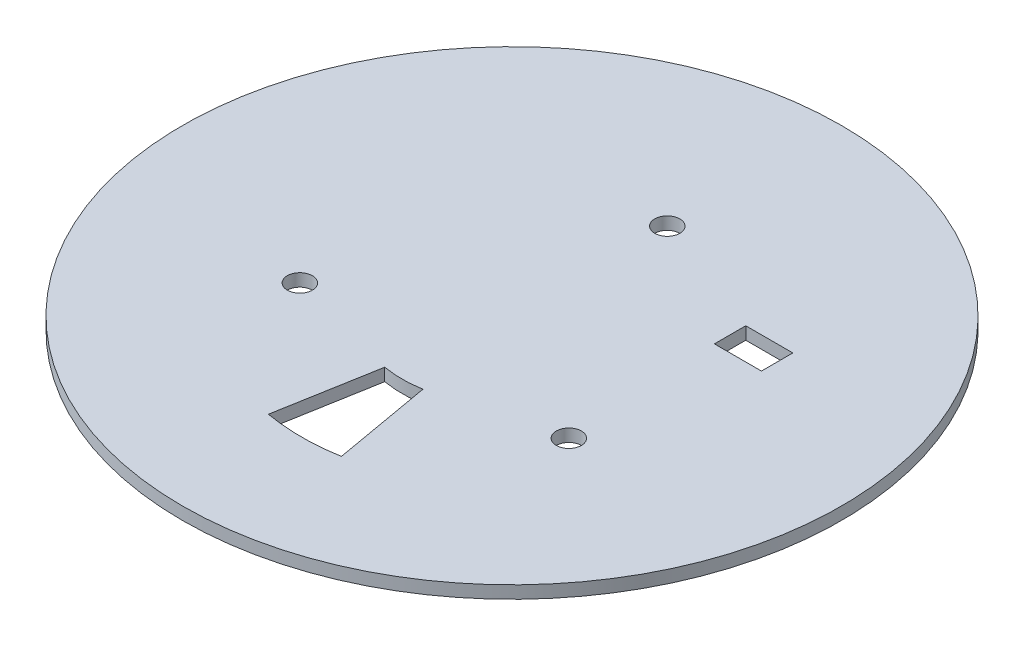
ISO-10303-21;
HEADER;
FILE_DESCRIPTION(('STEP AP214'),'2;1');
FILE_NAME('part.step','',(''),(''),'','','');
FILE_SCHEMA(('AUTOMOTIVE_DESIGN { 1 0 10303 214 1 1 1 1 }'));
ENDSEC;
DATA;
#1=APPLICATION_CONTEXT('core data for automotive mechanical design processes');
#2=APPLICATION_PROTOCOL_DEFINITION('international standard','automotive_design',2000,#1);
#3=PRODUCT_CONTEXT('',#1,'mechanical');
#4=PRODUCT('Part','Part','',(#3));
#5=PRODUCT_RELATED_PRODUCT_CATEGORY('part','',(#4));
#6=PRODUCT_DEFINITION_FORMATION('','',#4);
#7=PRODUCT_DEFINITION_CONTEXT('part definition',#1,'design');
#8=PRODUCT_DEFINITION('design','',#6,#7);
#9=PRODUCT_DEFINITION_SHAPE('','',#8);
#10=(LENGTH_UNIT() NAMED_UNIT(*) SI_UNIT(.MILLI.,.METRE.));
#11=(NAMED_UNIT(*) PLANE_ANGLE_UNIT() SI_UNIT($,.RADIAN.));
#12=(NAMED_UNIT(*) SI_UNIT($,.STERADIAN.) SOLID_ANGLE_UNIT());
#13=UNCERTAINTY_MEASURE_WITH_UNIT(LENGTH_MEASURE(1.E-05),#10,'distance_accuracy_value','');
#14=(GEOMETRIC_REPRESENTATION_CONTEXT(3) GLOBAL_UNCERTAINTY_ASSIGNED_CONTEXT((#13)) GLOBAL_UNIT_ASSIGNED_CONTEXT((#10,
#11,#12)) REPRESENTATION_CONTEXT('',''));
#15=CARTESIAN_POINT('',(0.,0.,0.));
#16=DIRECTION('',(0.,0.,1.));
#17=DIRECTION('',(1.,0.,0.));
#18=AXIS2_PLACEMENT_3D('',#15,#16,#17);
#19=CARTESIAN_POINT('',(0.,4.,0.));
#20=DIRECTION('',(0.,-1.,0.));
#21=DIRECTION('',(0.,0.,-1.));
#22=AXIS2_PLACEMENT_3D('',#19,#20,#21);
#23=CYLINDRICAL_SURFACE('',#22,105.);
#24=CARTESIAN_POINT('',(0.,4.,0.));
#25=DIRECTION('',(0.,1.,0.));
#26=DIRECTION('',(0.,0.,1.));
#27=AXIS2_PLACEMENT_3D('',#24,#25,#26);
#28=CIRCLE('',#27,105.);
#29=CARTESIAN_POINT('',(0.,4.,105.));
#30=VERTEX_POINT('',#29);
#31=EDGE_CURVE('E11',#30,#30,#28,.T.);
#32=ORIENTED_EDGE('',*,*,#31,.F.);
#33=EDGE_LOOP('',(#32));
#34=FACE_BOUND('',#33,.T.);
#35=CARTESIAN_POINT('',(0.,0.,0.));
#36=DIRECTION('',(0.,1.,0.));
#37=DIRECTION('',(0.,0.,1.));
#38=AXIS2_PLACEMENT_3D('',#35,#36,#37);
#39=CIRCLE('',#38,105.);
#40=CARTESIAN_POINT('',(0.,0.,105.));
#41=VERTEX_POINT('',#40);
#42=EDGE_CURVE('E36',#41,#41,#39,.T.);
#43=ORIENTED_EDGE('',*,*,#42,.T.);
#44=EDGE_LOOP('',(#43));
#45=FACE_BOUND('',#44,.T.);
#46=ADVANCED_FACE('F33',(#34,#45),#23,.T.);
#47=CARTESIAN_POINT('',(0.,4.,0.));
#48=DIRECTION('',(0.,1.,0.));
#49=DIRECTION('',(0.,0.,1.));
#50=AXIS2_PLACEMENT_3D('',#47,#48,#49);
#51=PLANE('',#50);
#52=DIRECTION('',(0.,0.,1.));
#53=VECTOR('',#52,1.);
#54=CARTESIAN_POINT('',(40.,4.,-34.48));
#55=LINE('',#54,#53);
#56=CARTESIAN_POINT('',(40.,4.,-34.48));
#57=VERTEX_POINT('',#56);
#58=CARTESIAN_POINT('',(40.,4.,-24.48));
#59=VERTEX_POINT('',#58);
#60=EDGE_CURVE('E47',#57,#59,#55,.T.);
#61=ORIENTED_EDGE('',*,*,#60,.F.);
#62=DIRECTION('',(-1.,0.,0.));
#63=VECTOR('',#62,1.);
#64=CARTESIAN_POINT('',(55.,4.,-34.48));
#65=LINE('',#64,#63);
#66=CARTESIAN_POINT('',(55.,4.,-34.48));
#67=VERTEX_POINT('',#66);
#68=EDGE_CURVE('E105',#67,#57,#65,.T.);
#69=ORIENTED_EDGE('',*,*,#68,.F.);
#70=DIRECTION('',(0.,0.,-1.));
#71=VECTOR('',#70,1.);
#72=CARTESIAN_POINT('',(55.,4.,-24.48));
#73=LINE('',#72,#71);
#74=CARTESIAN_POINT('',(55.,4.,-24.48));
#75=VERTEX_POINT('',#74);
#76=EDGE_CURVE('E125',#75,#67,#73,.T.);
#77=ORIENTED_EDGE('',*,*,#76,.F.);
#78=DIRECTION('',(1.,0.,0.));
#79=VECTOR('',#78,1.);
#80=CARTESIAN_POINT('',(40.,4.,-24.48));
#81=LINE('',#80,#79);
#82=EDGE_CURVE('E119',#59,#75,#81,.T.);
#83=ORIENTED_EDGE('',*,*,#82,.F.);
#84=EDGE_LOOP('',(#61,#69,#77,#83));
#85=FACE_BOUND('',#84,.T.);
#86=CARTESIAN_POINT('',(42.850936979254,4.,24.74));
#87=DIRECTION('',(0.,1.,0.));
#88=DIRECTION('',(0.,0.,1.));
#89=AXIS2_PLACEMENT_3D('',#86,#87,#88);
#90=CIRCLE('',#89,4.);
#91=CARTESIAN_POINT('',(42.850936979254,4.,28.74));
#92=VERTEX_POINT('',#91);
#93=EDGE_CURVE('E138',#92,#92,#90,.T.);
#94=ORIENTED_EDGE('',*,*,#93,.F.);
#95=EDGE_LOOP('',(#94));
#96=FACE_BOUND('',#95,.T.);
#97=CARTESIAN_POINT('',(0.,4.,-49.48));
#98=DIRECTION('',(0.,1.,0.));
#99=DIRECTION('',(0.,0.,1.));
#100=AXIS2_PLACEMENT_3D('',#97,#98,#99);
#101=CIRCLE('',#100,4.);
#102=CARTESIAN_POINT('',(0.,4.,-45.48));
#103=VERTEX_POINT('',#102);
#104=EDGE_CURVE('E144',#103,#103,#101,.T.);
#105=ORIENTED_EDGE('',*,*,#104,.F.);
#106=EDGE_LOOP('',(#105));
#107=FACE_BOUND('',#106,.T.);
#108=CARTESIAN_POINT('',(-42.8509369792542,4.,24.7399999999997));
#109=DIRECTION('',(0.,1.,0.));
#110=DIRECTION('',(0.,0.,1.));
#111=AXIS2_PLACEMENT_3D('',#108,#109,#110);
#112=CIRCLE('',#111,4.00000000000001);
#113=CARTESIAN_POINT('',(-42.8509369792542,4.,28.7399999999997));
#114=VERTEX_POINT('',#113);
#115=EDGE_CURVE('E111',#114,#114,#112,.T.);
#116=ORIENTED_EDGE('',*,*,#115,.F.);
#117=EDGE_LOOP('',(#116));
#118=FACE_BOUND('',#117,.T.);
#119=CARTESIAN_POINT('',(0.,4.,0.));
#120=DIRECTION('',(0.,1.,0.));
#121=DIRECTION('',(0.,0.,1.));
#122=AXIS2_PLACEMENT_3D('',#119,#120,#121);
#123=CIRCLE('',#122,67.);
#124=CARTESIAN_POINT('',(-11.6344279036839,4.,65.982119451818));
#125=VERTEX_POINT('',#124);
#126=CARTESIAN_POINT('',(11.6344279036839,4.,65.982119451818));
#127=VERTEX_POINT('',#126);
#128=EDGE_CURVE('E137',#125,#127,#123,.T.);
#129=ORIENTED_EDGE('',*,*,#128,.F.);
#130=DIRECTION('',(-0.173648177666923,0.,0.984807753012209));
#131=VECTOR('',#130,1.);
#132=CARTESIAN_POINT('',(-6.07768621834235,4.,34.4682713554273));
#133=LINE('',#132,#131);
#134=CARTESIAN_POINT('',(-6.07768621834235,4.,34.4682713554273));
#135=VERTEX_POINT('',#134);
#136=EDGE_CURVE('E156',#135,#125,#133,.T.);
#137=ORIENTED_EDGE('',*,*,#136,.F.);
#138=CARTESIAN_POINT('',(0.,4.,0.));
#139=DIRECTION('',(0.,-1.,0.));
#140=DIRECTION('',(0.,0.,1.));
#141=AXIS2_PLACEMENT_3D('',#138,#139,#140);
#142=CIRCLE('',#141,35.);
#143=CARTESIAN_POINT('',(6.0776862183423,4.,34.4682713554273));
#144=VERTEX_POINT('',#143);
#145=EDGE_CURVE('E170',#144,#135,#142,.T.);
#146=ORIENTED_EDGE('',*,*,#145,.F.);
#147=DIRECTION('',(-0.173648177666923,0.,-0.984807753012209));
#148=VECTOR('',#147,1.);
#149=CARTESIAN_POINT('',(6.07768621834231,4.,34.4682713554273));
#150=LINE('',#149,#148);
#151=EDGE_CURVE('E167',#127,#144,#150,.T.);
#152=ORIENTED_EDGE('',*,*,#151,.F.);
#153=EDGE_LOOP('',(#129,#137,#146,#152));
#154=FACE_BOUND('',#153,.T.);
#155=ORIENTED_EDGE('',*,*,#31,.T.);
#156=EDGE_LOOP('',(#155));
#157=FACE_BOUND('',#156,.T.);
#158=ADVANCED_FACE('F192',(#85,#96,#107,#118,#154,#157),#51,.T.);
#159=CARTESIAN_POINT('',(0.,0.,0.));
#160=DIRECTION('',(0.,1.,0.));
#161=DIRECTION('',(0.,0.,1.));
#162=AXIS2_PLACEMENT_3D('',#159,#160,#161);
#163=PLANE('',#162);
#164=DIRECTION('',(1.,0.,0.));
#165=VECTOR('',#164,1.);
#166=CARTESIAN_POINT('',(55.,0.,-34.48));
#167=LINE('',#166,#165);
#168=CARTESIAN_POINT('',(40.,0.,-34.48));
#169=VERTEX_POINT('',#168);
#170=CARTESIAN_POINT('',(55.,0.,-34.48));
#171=VERTEX_POINT('',#170);
#172=EDGE_CURVE('E117',#169,#171,#167,.T.);
#173=ORIENTED_EDGE('',*,*,#172,.F.);
#174=DIRECTION('',(0.,0.,-1.));
#175=VECTOR('',#174,1.);
#176=CARTESIAN_POINT('',(40.,0.,-34.48));
#177=LINE('',#176,#175);
#178=CARTESIAN_POINT('',(40.,0.,-24.48));
#179=VERTEX_POINT('',#178);
#180=EDGE_CURVE('E99',#179,#169,#177,.T.);
#181=ORIENTED_EDGE('',*,*,#180,.F.);
#182=DIRECTION('',(-1.,0.,0.));
#183=VECTOR('',#182,1.);
#184=CARTESIAN_POINT('',(40.,0.,-24.48));
#185=LINE('',#184,#183);
#186=CARTESIAN_POINT('',(55.,0.,-24.48));
#187=VERTEX_POINT('',#186);
#188=EDGE_CURVE('E108',#187,#179,#185,.T.);
#189=ORIENTED_EDGE('',*,*,#188,.F.);
#190=DIRECTION('',(0.,0.,1.));
#191=VECTOR('',#190,1.);
#192=CARTESIAN_POINT('',(55.,0.,-24.48));
#193=LINE('',#192,#191);
#194=EDGE_CURVE('E55',#171,#187,#193,.T.);
#195=ORIENTED_EDGE('',*,*,#194,.F.);
#196=EDGE_LOOP('',(#173,#181,#189,#195));
#197=FACE_BOUND('',#196,.T.);
#198=CARTESIAN_POINT('',(42.850936979254,0.,24.74));
#199=DIRECTION('',(0.,1.,0.));
#200=DIRECTION('',(0.,0.,1.));
#201=AXIS2_PLACEMENT_3D('',#198,#199,#200);
#202=CIRCLE('',#201,4.);
#203=CARTESIAN_POINT('',(42.850936979254,0.,28.74));
#204=VERTEX_POINT('',#203);
#205=EDGE_CURVE('E134',#204,#204,#202,.T.);
#206=ORIENTED_EDGE('',*,*,#205,.T.);
#207=EDGE_LOOP('',(#206));
#208=FACE_BOUND('',#207,.T.);
#209=CARTESIAN_POINT('',(0.,0.,-49.48));
#210=DIRECTION('',(0.,1.,0.));
#211=DIRECTION('',(0.,0.,1.));
#212=AXIS2_PLACEMENT_3D('',#209,#210,#211);
#213=CIRCLE('',#212,4.);
#214=CARTESIAN_POINT('',(0.,0.,-45.48));
#215=VERTEX_POINT('',#214);
#216=EDGE_CURVE('E141',#215,#215,#213,.T.);
#217=ORIENTED_EDGE('',*,*,#216,.T.);
#218=EDGE_LOOP('',(#217));
#219=FACE_BOUND('',#218,.T.);
#220=CARTESIAN_POINT('',(-42.8509369792542,0.,24.7399999999997));
#221=DIRECTION('',(0.,1.,0.));
#222=DIRECTION('',(0.,0.,1.));
#223=AXIS2_PLACEMENT_3D('',#220,#221,#222);
#224=CIRCLE('',#223,4.00000000000001);
#225=CARTESIAN_POINT('',(-42.8509369792542,0.,28.7399999999997));
#226=VERTEX_POINT('',#225);
#227=EDGE_CURVE('E147',#226,#226,#224,.T.);
#228=ORIENTED_EDGE('',*,*,#227,.T.);
#229=EDGE_LOOP('',(#228));
#230=FACE_BOUND('',#229,.T.);
#231=DIRECTION('',(-0.173648177666923,0.,0.984807753012209));
#232=VECTOR('',#231,1.);
#233=CARTESIAN_POINT('',(-6.07768621834235,0.,34.4682713554273));
#234=LINE('',#233,#232);
#235=CARTESIAN_POINT('',(-6.07768621834235,0.,34.4682713554273));
#236=VERTEX_POINT('',#235);
#237=CARTESIAN_POINT('',(-11.6344279036839,0.,65.982119451818));
#238=VERTEX_POINT('',#237);
#239=EDGE_CURVE('E162',#236,#238,#234,.T.);
#240=ORIENTED_EDGE('',*,*,#239,.T.);
#241=CARTESIAN_POINT('',(0.,0.,0.));
#242=DIRECTION('',(0.,1.,0.));
#243=DIRECTION('',(0.,0.,1.));
#244=AXIS2_PLACEMENT_3D('',#241,#242,#243);
#245=CIRCLE('',#244,67.);
#246=CARTESIAN_POINT('',(11.6344279036839,0.,65.982119451818));
#247=VERTEX_POINT('',#246);
#248=EDGE_CURVE('E152',#238,#247,#245,.T.);
#249=ORIENTED_EDGE('',*,*,#248,.T.);
#250=DIRECTION('',(-0.173648177666923,0.,-0.984807753012209));
#251=VECTOR('',#250,1.);
#252=CARTESIAN_POINT('',(6.07768621834231,0.,34.4682713554273));
#253=LINE('',#252,#251);
#254=CARTESIAN_POINT('',(6.0776862183423,0.,34.4682713554273));
#255=VERTEX_POINT('',#254);
#256=EDGE_CURVE('E155',#247,#255,#253,.T.);
#257=ORIENTED_EDGE('',*,*,#256,.T.);
#258=CARTESIAN_POINT('',(0.,0.,0.));
#259=DIRECTION('',(0.,-1.,0.));
#260=DIRECTION('',(0.,0.,1.));
#261=AXIS2_PLACEMENT_3D('',#258,#259,#260);
#262=CIRCLE('',#261,35.);
#263=EDGE_CURVE('E159',#255,#236,#262,.T.);
#264=ORIENTED_EDGE('',*,*,#263,.T.);
#265=EDGE_LOOP('',(#240,#249,#257,#264));
#266=FACE_BOUND('',#265,.T.);
#267=ORIENTED_EDGE('',*,*,#42,.F.);
#268=EDGE_LOOP('',(#267));
#269=FACE_BOUND('',#268,.T.);
#270=ADVANCED_FACE('F114',(#197,#208,#219,#230,#266,#269),#163,.F.);
#271=CARTESIAN_POINT('',(0.,0.,0.));
#272=DIRECTION('',(0.,1.,0.));
#273=DIRECTION('',(0.,0.,1.));
#274=AXIS2_PLACEMENT_3D('',#271,#272,#273);
#275=CYLINDRICAL_SURFACE('',#274,67.);
#276=ORIENTED_EDGE('',*,*,#128,.T.);
#277=DIRECTION('',(0.,1.,0.));
#278=VECTOR('',#277,1.);
#279=CARTESIAN_POINT('',(11.6344279036839,0.,65.982119451818));
#280=LINE('',#279,#278);
#281=EDGE_CURVE('E165',#247,#127,#280,.T.);
#282=ORIENTED_EDGE('',*,*,#281,.F.);
#283=ORIENTED_EDGE('',*,*,#248,.F.);
#284=DIRECTION('',(0.,1.,0.));
#285=VECTOR('',#284,1.);
#286=CARTESIAN_POINT('',(-11.6344279036839,0.,65.982119451818));
#287=LINE('',#286,#285);
#288=EDGE_CURVE('E175',#238,#125,#287,.T.);
#289=ORIENTED_EDGE('',*,*,#288,.T.);
#290=EDGE_LOOP('',(#276,#282,#283,#289));
#291=FACE_BOUND('',#290,.T.);
#292=ADVANCED_FACE('F200',(#291),#275,.F.);
#293=CARTESIAN_POINT('',(-6.07768621834235,0.,34.4682713554273));
#294=DIRECTION('',(-0.984807753012209,0.,-0.173648177666923));
#295=DIRECTION('',(-0.173648177666923,0.,0.984807753012209));
#296=AXIS2_PLACEMENT_3D('',#293,#294,#295);
#297=PLANE('',#296);
#298=ORIENTED_EDGE('',*,*,#136,.T.);
#299=ORIENTED_EDGE('',*,*,#288,.F.);
#300=ORIENTED_EDGE('',*,*,#239,.F.);
#301=DIRECTION('',(0.,1.,0.));
#302=VECTOR('',#301,1.);
#303=CARTESIAN_POINT('',(-6.07768621834235,0.,34.4682713554273));
#304=LINE('',#303,#302);
#305=EDGE_CURVE('E177',#236,#135,#304,.T.);
#306=ORIENTED_EDGE('',*,*,#305,.T.);
#307=EDGE_LOOP('',(#298,#299,#300,#306));
#308=FACE_BOUND('',#307,.T.);
#309=ADVANCED_FACE('F202',(#308),#297,.F.);
#310=CARTESIAN_POINT('',(0.,0.,0.));
#311=DIRECTION('',(0.,1.,0.));
#312=DIRECTION('',(0.,0.,1.));
#313=AXIS2_PLACEMENT_3D('',#310,#311,#312);
#314=CYLINDRICAL_SURFACE('',#313,35.);
#315=ORIENTED_EDGE('',*,*,#145,.T.);
#316=ORIENTED_EDGE('',*,*,#305,.F.);
#317=ORIENTED_EDGE('',*,*,#263,.F.);
#318=DIRECTION('',(0.,1.,0.));
#319=VECTOR('',#318,1.);
#320=CARTESIAN_POINT('',(6.0776862183423,0.,34.4682713554273));
#321=LINE('',#320,#319);
#322=EDGE_CURVE('E179',#255,#144,#321,.T.);
#323=ORIENTED_EDGE('',*,*,#322,.T.);
#324=EDGE_LOOP('',(#315,#316,#317,#323));
#325=FACE_BOUND('',#324,.T.);
#326=ADVANCED_FACE('F196',(#325),#314,.T.);
#327=CARTESIAN_POINT('',(6.07768621834231,0.,34.4682713554273));
#328=DIRECTION('',(0.984807753012209,0.,-0.173648177666923));
#329=DIRECTION('',(-0.173648177666923,0.,-0.984807753012209));
#330=AXIS2_PLACEMENT_3D('',#327,#328,#329);
#331=PLANE('',#330);
#332=ORIENTED_EDGE('',*,*,#151,.T.);
#333=ORIENTED_EDGE('',*,*,#322,.F.);
#334=ORIENTED_EDGE('',*,*,#256,.F.);
#335=ORIENTED_EDGE('',*,*,#281,.T.);
#336=EDGE_LOOP('',(#332,#333,#334,#335));
#337=FACE_BOUND('',#336,.T.);
#338=ADVANCED_FACE('F185',(#337),#331,.F.);
#339=CARTESIAN_POINT('',(-42.8509369792542,0.,24.7399999999997));
#340=DIRECTION('',(0.,1.,0.));
#341=DIRECTION('',(0.,0.,1.));
#342=AXIS2_PLACEMENT_3D('',#339,#340,#341);
#343=CYLINDRICAL_SURFACE('',#342,4.00000000000001);
#344=ORIENTED_EDGE('',*,*,#227,.F.);
#345=EDGE_LOOP('',(#344));
#346=FACE_BOUND('',#345,.T.);
#347=ORIENTED_EDGE('',*,*,#115,.T.);
#348=EDGE_LOOP('',(#347));
#349=FACE_BOUND('',#348,.T.);
#350=ADVANCED_FACE('F230',(#346,#349),#343,.F.);
#351=CARTESIAN_POINT('',(0.,0.,-49.48));
#352=DIRECTION('',(0.,1.,0.));
#353=DIRECTION('',(0.,0.,1.));
#354=AXIS2_PLACEMENT_3D('',#351,#352,#353);
#355=CYLINDRICAL_SURFACE('',#354,4.);
#356=ORIENTED_EDGE('',*,*,#216,.F.);
#357=EDGE_LOOP('',(#356));
#358=FACE_BOUND('',#357,.T.);
#359=ORIENTED_EDGE('',*,*,#104,.T.);
#360=EDGE_LOOP('',(#359));
#361=FACE_BOUND('',#360,.T.);
#362=ADVANCED_FACE('F234',(#358,#361),#355,.F.);
#363=CARTESIAN_POINT('',(42.850936979254,0.,24.74));
#364=DIRECTION('',(0.,1.,0.));
#365=DIRECTION('',(0.,0.,1.));
#366=AXIS2_PLACEMENT_3D('',#363,#364,#365);
#367=CYLINDRICAL_SURFACE('',#366,4.);
#368=ORIENTED_EDGE('',*,*,#205,.F.);
#369=EDGE_LOOP('',(#368));
#370=FACE_BOUND('',#369,.T.);
#371=ORIENTED_EDGE('',*,*,#93,.T.);
#372=EDGE_LOOP('',(#371));
#373=FACE_BOUND('',#372,.T.);
#374=ADVANCED_FACE('F239',(#370,#373),#367,.F.);
#375=CARTESIAN_POINT('',(40.,-0.00100000000000013,-34.48));
#376=DIRECTION('',(-1.,0.,0.));
#377=DIRECTION('',(0.,0.,1.));
#378=AXIS2_PLACEMENT_3D('',#375,#376,#377);
#379=PLANE('',#378);
#380=ORIENTED_EDGE('',*,*,#180,.T.);
#381=DIRECTION('',(0.,1.,0.));
#382=VECTOR('',#381,1.);
#383=CARTESIAN_POINT('',(40.,-0.00100000000000013,-34.48));
#384=LINE('',#383,#382);
#385=EDGE_CURVE('E112',#169,#57,#384,.T.);
#386=ORIENTED_EDGE('',*,*,#385,.T.);
#387=ORIENTED_EDGE('',*,*,#60,.T.);
#388=DIRECTION('',(0.,1.,0.));
#389=VECTOR('',#388,1.);
#390=CARTESIAN_POINT('',(40.,-0.00100000000000013,-24.48));
#391=LINE('',#390,#389);
#392=EDGE_CURVE('E95',#179,#59,#391,.T.);
#393=ORIENTED_EDGE('',*,*,#392,.F.);
#394=EDGE_LOOP('',(#380,#386,#387,#393));
#395=FACE_BOUND('',#394,.T.);
#396=ADVANCED_FACE('F97',(#395),#379,.F.);
#397=CARTESIAN_POINT('',(55.,-0.00100000000000013,-34.48));
#398=DIRECTION('',(0.,0.,-1.));
#399=DIRECTION('',(-1.,0.,0.));
#400=AXIS2_PLACEMENT_3D('',#397,#398,#399);
#401=PLANE('',#400);
#402=ORIENTED_EDGE('',*,*,#172,.T.);
#403=DIRECTION('',(0.,1.,0.));
#404=VECTOR('',#403,1.);
#405=CARTESIAN_POINT('',(55.,-0.00100000000000013,-34.48));
#406=LINE('',#405,#404);
#407=EDGE_CURVE('E131',#171,#67,#406,.T.);
#408=ORIENTED_EDGE('',*,*,#407,.T.);
#409=ORIENTED_EDGE('',*,*,#68,.T.);
#410=ORIENTED_EDGE('',*,*,#385,.F.);
#411=EDGE_LOOP('',(#402,#408,#409,#410));
#412=FACE_BOUND('',#411,.T.);
#413=ADVANCED_FACE('F250',(#412),#401,.F.);
#414=CARTESIAN_POINT('',(55.,-0.00100000000000013,-24.48));
#415=DIRECTION('',(1.,0.,0.));
#416=DIRECTION('',(0.,0.,-1.));
#417=AXIS2_PLACEMENT_3D('',#414,#415,#416);
#418=PLANE('',#417);
#419=ORIENTED_EDGE('',*,*,#194,.T.);
#420=DIRECTION('',(0.,1.,0.));
#421=VECTOR('',#420,1.);
#422=CARTESIAN_POINT('',(55.,-0.00100000000000013,-24.48));
#423=LINE('',#422,#421);
#424=EDGE_CURVE('E104',#187,#75,#423,.T.);
#425=ORIENTED_EDGE('',*,*,#424,.T.);
#426=ORIENTED_EDGE('',*,*,#76,.T.);
#427=ORIENTED_EDGE('',*,*,#407,.F.);
#428=EDGE_LOOP('',(#419,#425,#426,#427));
#429=FACE_BOUND('',#428,.T.);
#430=ADVANCED_FACE('F253',(#429),#418,.F.);
#431=CARTESIAN_POINT('',(40.,-0.00100000000000013,-24.48));
#432=DIRECTION('',(0.,0.,1.));
#433=DIRECTION('',(1.,0.,0.));
#434=AXIS2_PLACEMENT_3D('',#431,#432,#433);
#435=PLANE('',#434);
#436=ORIENTED_EDGE('',*,*,#188,.T.);
#437=ORIENTED_EDGE('',*,*,#392,.T.);
#438=ORIENTED_EDGE('',*,*,#82,.T.);
#439=ORIENTED_EDGE('',*,*,#424,.F.);
#440=EDGE_LOOP('',(#436,#437,#438,#439));
#441=FACE_BOUND('',#440,.T.);
#442=ADVANCED_FACE('F109',(#441),#435,.F.);
#443=CLOSED_SHELL('',(#46,#158,#270,#292,#309,#326,#338,#350,#362,#374,#396,#413,#430,#442));
#444=MANIFOLD_SOLID_BREP('B2',#443);
#445=ADVANCED_BREP_SHAPE_REPRESENTATION('',(#18,#444),#14);
#446=SHAPE_DEFINITION_REPRESENTATION(#9,#445);
ENDSEC;
END-ISO-10303-21;
